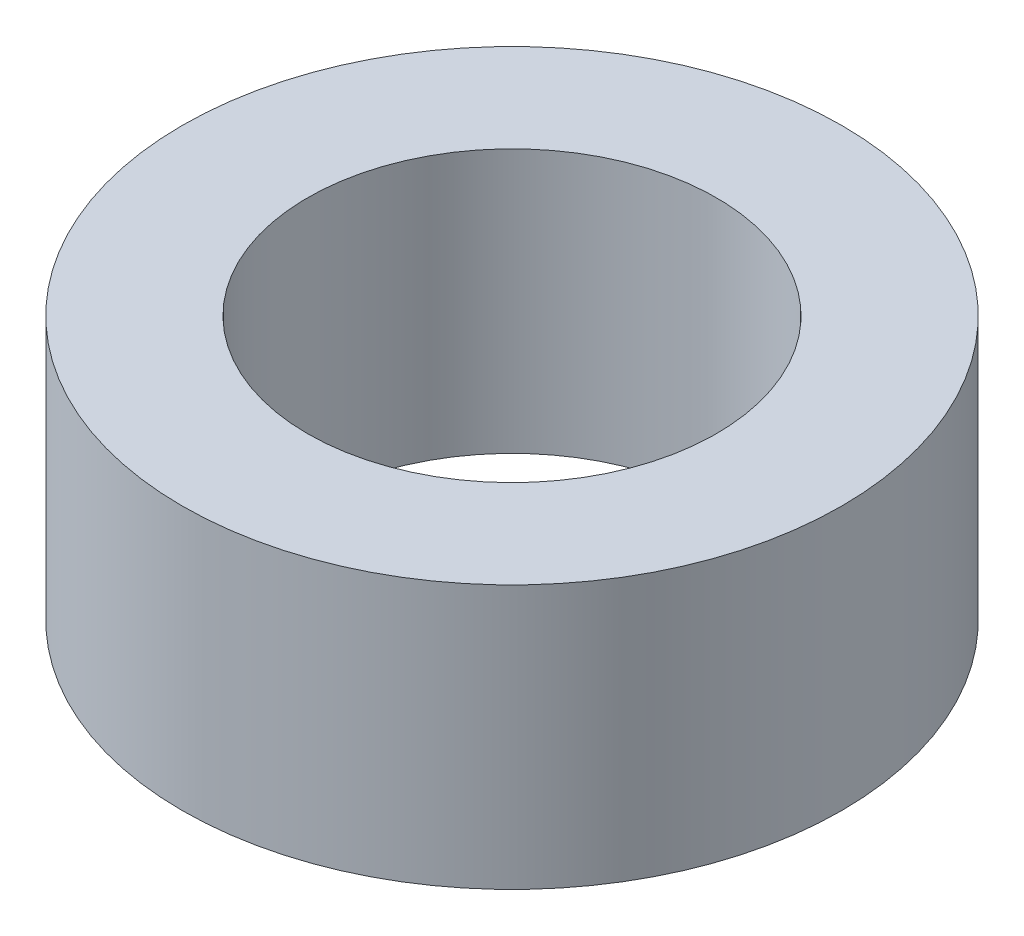
ISO-10303-21;
HEADER;
FILE_DESCRIPTION(('STEP AP214'),'2;1');
FILE_NAME('part.step','',(''),(''),'','','');
FILE_SCHEMA(('AUTOMOTIVE_DESIGN { 1 0 10303 214 1 1 1 1 }'));
ENDSEC;
DATA;
#1=APPLICATION_CONTEXT('core data for automotive mechanical design processes');
#2=APPLICATION_PROTOCOL_DEFINITION('international standard','automotive_design',2000,#1);
#3=PRODUCT_CONTEXT('',#1,'mechanical');
#4=PRODUCT('Part','Part','',(#3));
#5=PRODUCT_RELATED_PRODUCT_CATEGORY('part','',(#4));
#6=PRODUCT_DEFINITION_FORMATION('','',#4);
#7=PRODUCT_DEFINITION_CONTEXT('part definition',#1,'design');
#8=PRODUCT_DEFINITION('design','',#6,#7);
#9=PRODUCT_DEFINITION_SHAPE('','',#8);
#10=(LENGTH_UNIT() NAMED_UNIT(*) SI_UNIT(.MILLI.,.METRE.));
#11=(NAMED_UNIT(*) PLANE_ANGLE_UNIT() SI_UNIT($,.RADIAN.));
#12=(NAMED_UNIT(*) SI_UNIT($,.STERADIAN.) SOLID_ANGLE_UNIT());
#13=UNCERTAINTY_MEASURE_WITH_UNIT(LENGTH_MEASURE(1.E-05),#10,'distance_accuracy_value','');
#14=(GEOMETRIC_REPRESENTATION_CONTEXT(3) GLOBAL_UNCERTAINTY_ASSIGNED_CONTEXT((#13)) GLOBAL_UNIT_ASSIGNED_CONTEXT((#10,
#11,#12)) REPRESENTATION_CONTEXT('',''));
#15=CARTESIAN_POINT('',(0.,0.,0.));
#16=DIRECTION('',(0.,0.,1.));
#17=DIRECTION('',(1.,0.,0.));
#18=AXIS2_PLACEMENT_3D('',#15,#16,#17);
#19=CARTESIAN_POINT('',(0.,2.,0.));
#20=DIRECTION('',(0.,1.,0.));
#21=DIRECTION('',(0.,0.,1.));
#22=AXIS2_PLACEMENT_3D('',#19,#20,#21);
#23=PLANE('',#22);
#24=CARTESIAN_POINT('',(0.,2.,0.));
#25=DIRECTION('',(0.,1.,0.));
#26=DIRECTION('',(0.,0.,1.));
#27=AXIS2_PLACEMENT_3D('',#24,#25,#26);
#28=CIRCLE('',#27,2.5);
#29=CARTESIAN_POINT('',(0.,2.,2.5));
#30=VERTEX_POINT('',#29);
#31=EDGE_CURVE('E10',#30,#30,#28,.T.);
#32=ORIENTED_EDGE('',*,*,#31,.T.);
#33=EDGE_LOOP('',(#32));
#34=FACE_BOUND('',#33,.T.);
#35=CARTESIAN_POINT('',(0.,2.,0.));
#36=DIRECTION('',(0.,1.,0.));
#37=DIRECTION('',(0.,0.,1.));
#38=AXIS2_PLACEMENT_3D('',#35,#36,#37);
#39=CIRCLE('',#38,1.55);
#40=CARTESIAN_POINT('',(0.,2.,1.55));
#41=VERTEX_POINT('',#40);
#42=EDGE_CURVE('E43',#41,#41,#39,.T.);
#43=ORIENTED_EDGE('',*,*,#42,.F.);
#44=EDGE_LOOP('',(#43));
#45=FACE_BOUND('',#44,.T.);
#46=ADVANCED_FACE('F32',(#34,#45),#23,.T.);
#47=CARTESIAN_POINT('',(0.,0.,0.));
#48=DIRECTION('',(0.,1.,0.));
#49=DIRECTION('',(0.,0.,1.));
#50=AXIS2_PLACEMENT_3D('',#47,#48,#49);
#51=PLANE('',#50);
#52=CARTESIAN_POINT('',(0.,0.,0.));
#53=DIRECTION('',(0.,1.,0.));
#54=DIRECTION('',(0.,0.,1.));
#55=AXIS2_PLACEMENT_3D('',#52,#53,#54);
#56=CIRCLE('',#55,2.5);
#57=CARTESIAN_POINT('',(0.,0.,2.5));
#58=VERTEX_POINT('',#57);
#59=EDGE_CURVE('E36',#58,#58,#56,.T.);
#60=ORIENTED_EDGE('',*,*,#59,.F.);
#61=EDGE_LOOP('',(#60));
#62=FACE_BOUND('',#61,.T.);
#63=CARTESIAN_POINT('',(0.,0.,0.));
#64=DIRECTION('',(0.,1.,0.));
#65=DIRECTION('',(0.,0.,1.));
#66=AXIS2_PLACEMENT_3D('',#63,#64,#65);
#67=CIRCLE('',#66,1.55);
#68=CARTESIAN_POINT('',(0.,0.,1.55));
#69=VERTEX_POINT('',#68);
#70=EDGE_CURVE('E45',#69,#69,#67,.T.);
#71=ORIENTED_EDGE('',*,*,#70,.T.);
#72=EDGE_LOOP('',(#71));
#73=FACE_BOUND('',#72,.T.);
#74=ADVANCED_FACE('F55',(#62,#73),#51,.F.);
#75=CARTESIAN_POINT('',(0.,2.,0.));
#76=DIRECTION('',(0.,-1.,0.));
#77=DIRECTION('',(0.,0.,-1.));
#78=AXIS2_PLACEMENT_3D('',#75,#76,#77);
#79=CYLINDRICAL_SURFACE('',#78,2.5);
#80=ORIENTED_EDGE('',*,*,#31,.F.);
#81=EDGE_LOOP('',(#80));
#82=FACE_BOUND('',#81,.T.);
#83=ORIENTED_EDGE('',*,*,#59,.T.);
#84=EDGE_LOOP('',(#83));
#85=FACE_BOUND('',#84,.T.);
#86=ADVANCED_FACE('F34',(#82,#85),#79,.T.);
#87=CARTESIAN_POINT('',(0.,2.,0.));
#88=DIRECTION('',(0.,-1.,0.));
#89=DIRECTION('',(0.,0.,-1.));
#90=AXIS2_PLACEMENT_3D('',#87,#88,#89);
#91=CYLINDRICAL_SURFACE('',#90,1.55);
#92=ORIENTED_EDGE('',*,*,#42,.T.);
#93=EDGE_LOOP('',(#92));
#94=FACE_BOUND('',#93,.T.);
#95=ORIENTED_EDGE('',*,*,#70,.F.);
#96=EDGE_LOOP('',(#95));
#97=FACE_BOUND('',#96,.T.);
#98=ADVANCED_FACE('F51',(#94,#97),#91,.F.);
#99=CLOSED_SHELL('',(#46,#74,#86,#98));
#100=MANIFOLD_SOLID_BREP('B2',#99);
#101=ADVANCED_BREP_SHAPE_REPRESENTATION('',(#18,#100),#14);
#102=SHAPE_DEFINITION_REPRESENTATION(#9,#101);
ENDSEC;
END-ISO-10303-21;
